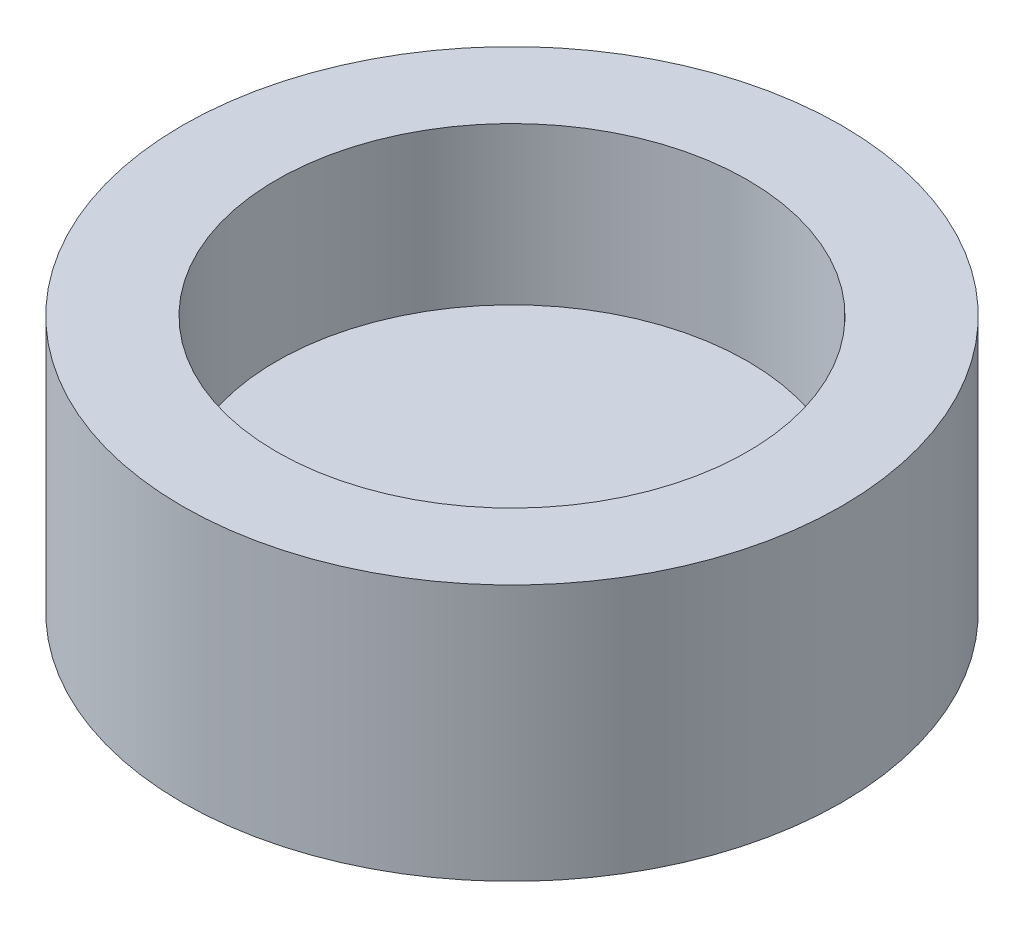
ISO-10303-21;
HEADER;
FILE_DESCRIPTION(('STEP AP214'),'2;1');
FILE_NAME('part.step','',(''),(''),'','','');
FILE_SCHEMA(('AUTOMOTIVE_DESIGN { 1 0 10303 214 1 1 1 1 }'));
ENDSEC;
DATA;
#1=APPLICATION_CONTEXT('core data for automotive mechanical design processes');
#2=APPLICATION_PROTOCOL_DEFINITION('international standard','automotive_design',2000,#1);
#3=PRODUCT_CONTEXT('',#1,'mechanical');
#4=PRODUCT('Part','Part','',(#3));
#5=PRODUCT_RELATED_PRODUCT_CATEGORY('part','',(#4));
#6=PRODUCT_DEFINITION_FORMATION('','',#4);
#7=PRODUCT_DEFINITION_CONTEXT('part definition',#1,'design');
#8=PRODUCT_DEFINITION('design','',#6,#7);
#9=PRODUCT_DEFINITION_SHAPE('','',#8);
#10=(LENGTH_UNIT() NAMED_UNIT(*) SI_UNIT(.MILLI.,.METRE.));
#11=(NAMED_UNIT(*) PLANE_ANGLE_UNIT() SI_UNIT($,.RADIAN.));
#12=(NAMED_UNIT(*) SI_UNIT($,.STERADIAN.) SOLID_ANGLE_UNIT());
#13=UNCERTAINTY_MEASURE_WITH_UNIT(LENGTH_MEASURE(1.E-05),#10,'distance_accuracy_value','');
#14=(GEOMETRIC_REPRESENTATION_CONTEXT(3) GLOBAL_UNCERTAINTY_ASSIGNED_CONTEXT((#13)) GLOBAL_UNIT_ASSIGNED_CONTEXT((#10,
#11,#12)) REPRESENTATION_CONTEXT('',''));
#15=CARTESIAN_POINT('',(0.,0.,0.));
#16=DIRECTION('',(0.,0.,1.));
#17=DIRECTION('',(1.,0.,0.));
#18=AXIS2_PLACEMENT_3D('',#15,#16,#17);
#19=CARTESIAN_POINT('',(0.,8.174080160432,0.));
#20=DIRECTION('',(0.,-1.,0.));
#21=DIRECTION('',(0.,0.,-1.));
#22=AXIS2_PLACEMENT_3D('',#19,#20,#21);
#23=CYLINDRICAL_SURFACE('',#22,10.5);
#24=CARTESIAN_POINT('',(0.,8.174080160432,0.));
#25=DIRECTION('',(0.,1.,0.));
#26=DIRECTION('',(0.,0.,1.));
#27=AXIS2_PLACEMENT_3D('',#24,#25,#26);
#28=CIRCLE('',#27,10.5);
#29=CARTESIAN_POINT('',(0.,8.174080160432,10.5));
#30=VERTEX_POINT('',#29);
#31=EDGE_CURVE('E10',#30,#30,#28,.T.);
#32=ORIENTED_EDGE('',*,*,#31,.F.);
#33=EDGE_LOOP('',(#32));
#34=FACE_BOUND('',#33,.T.);
#35=CARTESIAN_POINT('',(0.,0.,0.));
#36=DIRECTION('',(0.,1.,0.));
#37=DIRECTION('',(0.,0.,1.));
#38=AXIS2_PLACEMENT_3D('',#35,#36,#37);
#39=CIRCLE('',#38,10.5);
#40=CARTESIAN_POINT('',(0.,0.,10.5));
#41=VERTEX_POINT('',#40);
#42=EDGE_CURVE('E37',#41,#41,#39,.T.);
#43=ORIENTED_EDGE('',*,*,#42,.T.);
#44=EDGE_LOOP('',(#43));
#45=FACE_BOUND('',#44,.T.);
#46=ADVANCED_FACE('F34',(#34,#45),#23,.T.);
#47=CARTESIAN_POINT('',(0.,8.174080160432,0.));
#48=DIRECTION('',(0.,1.,0.));
#49=DIRECTION('',(0.,0.,1.));
#50=AXIS2_PLACEMENT_3D('',#47,#48,#49);
#51=PLANE('',#50);
#52=CARTESIAN_POINT('',(0.,8.174080160432,0.));
#53=DIRECTION('',(0.,-1.,0.));
#54=DIRECTION('',(0.,0.,-1.));
#55=AXIS2_PLACEMENT_3D('',#52,#53,#54);
#56=CIRCLE('',#55,7.5);
#57=CARTESIAN_POINT('',(0.,8.174080160432,-7.5));
#58=VERTEX_POINT('',#57);
#59=EDGE_CURVE('E48',#58,#58,#56,.T.);
#60=ORIENTED_EDGE('',*,*,#59,.T.);
#61=EDGE_LOOP('',(#60));
#62=FACE_BOUND('',#61,.T.);
#63=ORIENTED_EDGE('',*,*,#31,.T.);
#64=EDGE_LOOP('',(#63));
#65=FACE_BOUND('',#64,.T.);
#66=ADVANCED_FACE('F52',(#62,#65),#51,.T.);
#67=CARTESIAN_POINT('',(0.,0.,0.));
#68=DIRECTION('',(0.,1.,0.));
#69=DIRECTION('',(0.,0.,1.));
#70=AXIS2_PLACEMENT_3D('',#67,#68,#69);
#71=PLANE('',#70);
#72=ORIENTED_EDGE('',*,*,#42,.F.);
#73=EDGE_LOOP('',(#72));
#74=FACE_BOUND('',#73,.T.);
#75=ADVANCED_FACE('F62',(#74),#71,.F.);
#76=CARTESIAN_POINT('',(0.,3.174080160432,-7.5));
#77=DIRECTION('',(0.,-1.,0.));
#78=DIRECTION('',(0.,0.,-1.));
#79=AXIS2_PLACEMENT_3D('',#76,#77,#78);
#80=PLANE('',#79);
#81=CARTESIAN_POINT('',(0.,3.174080160432,0.));
#82=DIRECTION('',(0.,-1.,0.));
#83=DIRECTION('',(0.,0.,-1.));
#84=AXIS2_PLACEMENT_3D('',#81,#82,#83);
#85=CIRCLE('',#84,7.5);
#86=CARTESIAN_POINT('',(0.,3.174080160432,-7.5));
#87=VERTEX_POINT('',#86);
#88=EDGE_CURVE('E44',#87,#87,#85,.T.);
#89=ORIENTED_EDGE('',*,*,#88,.F.);
#90=EDGE_LOOP('',(#89));
#91=FACE_BOUND('',#90,.T.);
#92=ADVANCED_FACE('F57',(#91),#80,.F.);
#93=CARTESIAN_POINT('',(0.,0.0490987680048355,0.));
#94=DIRECTION('',(0.,-1.,0.));
#95=DIRECTION('',(0.,0.,-1.));
#96=AXIS2_PLACEMENT_3D('',#93,#94,#95);
#97=CYLINDRICAL_SURFACE('',#96,7.5);
#98=ORIENTED_EDGE('',*,*,#59,.F.);
#99=EDGE_LOOP('',(#98));
#100=FACE_BOUND('',#99,.T.);
#101=ORIENTED_EDGE('',*,*,#88,.T.);
#102=EDGE_LOOP('',(#101));
#103=FACE_BOUND('',#102,.T.);
#104=ADVANCED_FACE('F54',(#100,#103),#97,.F.);
#105=CLOSED_SHELL('',(#46,#66,#75,#92,#104));
#106=MANIFOLD_SOLID_BREP('B2',#105);
#107=ADVANCED_BREP_SHAPE_REPRESENTATION('',(#18,#106),#14);
#108=SHAPE_DEFINITION_REPRESENTATION(#9,#107);
ENDSEC;
END-ISO-10303-21;
